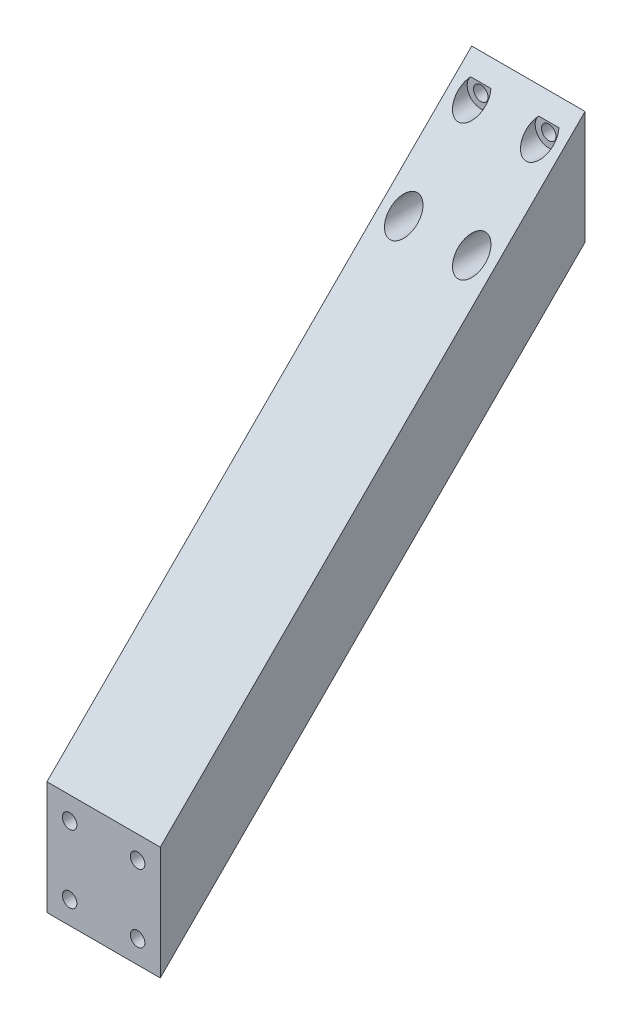
ISO-10303-21;
HEADER;
FILE_DESCRIPTION(('STEP AP214'),'2;1');
FILE_NAME('part.step','',(''),(''),'','','');
FILE_SCHEMA(('AUTOMOTIVE_DESIGN { 1 0 10303 214 1 1 1 1 }'));
ENDSEC;
DATA;
#1=APPLICATION_CONTEXT('core data for automotive mechanical design processes');
#2=APPLICATION_PROTOCOL_DEFINITION('international standard','automotive_design',2000,#1);
#3=PRODUCT_CONTEXT('',#1,'mechanical');
#4=PRODUCT('Part','Part','',(#3));
#5=PRODUCT_RELATED_PRODUCT_CATEGORY('part','',(#4));
#6=PRODUCT_DEFINITION_FORMATION('','',#4);
#7=PRODUCT_DEFINITION_CONTEXT('part definition',#1,'design');
#8=PRODUCT_DEFINITION('design','',#6,#7);
#9=PRODUCT_DEFINITION_SHAPE('','',#8);
#10=(LENGTH_UNIT() NAMED_UNIT(*) SI_UNIT(.MILLI.,.METRE.));
#11=(NAMED_UNIT(*) PLANE_ANGLE_UNIT() SI_UNIT($,.RADIAN.));
#12=(NAMED_UNIT(*) SI_UNIT($,.STERADIAN.) SOLID_ANGLE_UNIT());
#13=UNCERTAINTY_MEASURE_WITH_UNIT(LENGTH_MEASURE(1.E-05),#10,'distance_accuracy_value','');
#14=(GEOMETRIC_REPRESENTATION_CONTEXT(3) GLOBAL_UNCERTAINTY_ASSIGNED_CONTEXT((#13)) GLOBAL_UNIT_ASSIGNED_CONTEXT((#10,
#11,#12)) REPRESENTATION_CONTEXT('',''));
#15=CARTESIAN_POINT('',(0.,0.,0.));
#16=DIRECTION('',(0.,0.,1.));
#17=DIRECTION('',(1.,0.,0.));
#18=AXIS2_PLACEMENT_3D('',#15,#16,#17);
#19=CARTESIAN_POINT('',(25.,25.0000000000001,0.));
#20=DIRECTION('',(0.,0.,1.));
#21=DIRECTION('',(1.,0.,0.));
#22=AXIS2_PLACEMENT_3D('',#19,#20,#21);
#23=PLANE('',#22);
#24=CARTESIAN_POINT('',(20.,20.0000000000001,0.));
#25=DIRECTION('',(0.,0.,-1.));
#26=DIRECTION('',(-1.,0.,0.));
#27=AXIS2_PLACEMENT_3D('',#24,#25,#26);
#28=CIRCLE('',#27,1.6);
#29=CARTESIAN_POINT('',(18.4,20.0000000000001,0.));
#30=VERTEX_POINT('',#29);
#31=EDGE_CURVE('E135',#30,#30,#28,.T.);
#32=ORIENTED_EDGE('',*,*,#31,.F.);
#33=EDGE_LOOP('',(#32));
#34=FACE_BOUND('',#33,.T.);
#35=CARTESIAN_POINT('',(5.,5.00000000000011,0.));
#36=DIRECTION('',(0.,0.,-1.));
#37=DIRECTION('',(-1.,0.,0.));
#38=AXIS2_PLACEMENT_3D('',#35,#36,#37);
#39=CIRCLE('',#38,1.6);
#40=CARTESIAN_POINT('',(3.4,5.00000000000011,0.));
#41=VERTEX_POINT('',#40);
#42=EDGE_CURVE('E134',#41,#41,#39,.T.);
#43=ORIENTED_EDGE('',*,*,#42,.F.);
#44=EDGE_LOOP('',(#43));
#45=FACE_BOUND('',#44,.T.);
#46=CARTESIAN_POINT('',(20.,5.00000000000011,0.));
#47=DIRECTION('',(0.,0.,-1.));
#48=DIRECTION('',(-1.,0.,0.));
#49=AXIS2_PLACEMENT_3D('',#46,#47,#48);
#50=CIRCLE('',#49,1.6);
#51=CARTESIAN_POINT('',(18.4,5.00000000000011,0.));
#52=VERTEX_POINT('',#51);
#53=EDGE_CURVE('E126',#52,#52,#50,.T.);
#54=ORIENTED_EDGE('',*,*,#53,.F.);
#55=EDGE_LOOP('',(#54));
#56=FACE_BOUND('',#55,.T.);
#57=CARTESIAN_POINT('',(5.,20.0000000000001,0.));
#58=DIRECTION('',(0.,0.,-1.));
#59=DIRECTION('',(-1.,0.,0.));
#60=AXIS2_PLACEMENT_3D('',#57,#58,#59);
#61=CIRCLE('',#60,1.6);
#62=CARTESIAN_POINT('',(3.4,20.0000000000001,0.));
#63=VERTEX_POINT('',#62);
#64=EDGE_CURVE('E142',#63,#63,#61,.T.);
#65=ORIENTED_EDGE('',*,*,#64,.F.);
#66=EDGE_LOOP('',(#65));
#67=FACE_BOUND('',#66,.T.);
#68=DIRECTION('',(0.,1.,0.));
#69=VECTOR('',#68,1.);
#70=CARTESIAN_POINT('',(0.,25.0000000000001,0.));
#71=LINE('',#70,#69);
#72=CARTESIAN_POINT('',(0.,0.,0.));
#73=VERTEX_POINT('',#72);
#74=CARTESIAN_POINT('',(0.,25.0000000000001,0.));
#75=VERTEX_POINT('',#74);
#76=EDGE_CURVE('E178',#73,#75,#71,.T.);
#77=ORIENTED_EDGE('',*,*,#76,.T.);
#78=DIRECTION('',(-1.,0.,0.));
#79=VECTOR('',#78,1.);
#80=CARTESIAN_POINT('',(25.,25.0000000000001,0.));
#81=LINE('',#80,#79);
#82=CARTESIAN_POINT('',(25.,25.0000000000001,0.));
#83=VERTEX_POINT('',#82);
#84=EDGE_CURVE('E11',#83,#75,#81,.T.);
#85=ORIENTED_EDGE('',*,*,#84,.F.);
#86=DIRECTION('',(0.,1.,0.));
#87=VECTOR('',#86,1.);
#88=CARTESIAN_POINT('',(25.,25.0000000000001,0.));
#89=LINE('',#88,#87);
#90=CARTESIAN_POINT('',(25.,0.,0.));
#91=VERTEX_POINT('',#90);
#92=EDGE_CURVE('E179',#91,#83,#89,.T.);
#93=ORIENTED_EDGE('',*,*,#92,.F.);
#94=DIRECTION('',(-1.,0.,0.));
#95=VECTOR('',#94,1.);
#96=CARTESIAN_POINT('',(25.,0.,0.));
#97=LINE('',#96,#95);
#98=EDGE_CURVE('E189',#91,#73,#97,.T.);
#99=ORIENTED_EDGE('',*,*,#98,.T.);
#100=EDGE_LOOP('',(#77,#85,#93,#99));
#101=FACE_BOUND('',#100,.T.);
#102=ADVANCED_FACE('F33',(#34,#45,#56,#67,#101),#23,.F.);
#103=CARTESIAN_POINT('',(25.,-68.70992099,93.7099209899996));
#104=DIRECTION('',(0.,-0.707106781186546,-0.707106781186549));
#105=DIRECTION('',(0.,0.707106781186549,-0.707106781186546));
#106=AXIS2_PLACEMENT_3D('',#103,#104,#105);
#107=PLANE('',#106);
#108=DIRECTION('',(-1.,0.,0.));
#109=VECTOR('',#108,1.);
#110=CARTESIAN_POINT('',(5.,22.0000000000001,3.));
#111=LINE('',#110,#109);
#112=CARTESIAN_POINT('',(7.23606797749983,22.0000000000001,3.));
#113=VERTEX_POINT('',#112);
#114=CARTESIAN_POINT('',(2.76393202250017,22.0000000000001,3.));
#115=VERTEX_POINT('',#114);
#116=EDGE_CURVE('E152',#113,#115,#111,.T.);
#117=ORIENTED_EDGE('',*,*,#116,.F.);
#118=CARTESIAN_POINT('',(5.,20.0000000000001,4.99999999999995));
#119=DIRECTION('',(0.,-0.707106781186546,-0.707106781186549));
#120=DIRECTION('',(0.,0.707106781186549,-0.707106781186546));
#121=AXIS2_PLACEMENT_3D('',#118,#119,#120);
#122=ELLIPSE('',#121,4.24264068711928,3.);
#123=EDGE_CURVE('E169',#115,#113,#122,.F.);
#124=ORIENTED_EDGE('',*,*,#123,.F.);
#125=EDGE_LOOP('',(#117,#124));
#126=FACE_BOUND('',#125,.T.);
#127=CARTESIAN_POINT('',(5.,5.00000000000011,19.9999999999999));
#128=DIRECTION('',(0.,-0.707106781186546,-0.707106781186549));
#129=DIRECTION('',(0.,0.707106781186549,-0.707106781186546));
#130=AXIS2_PLACEMENT_3D('',#127,#128,#129);
#131=ELLIPSE('',#130,4.24264068711928,3.);
#132=CARTESIAN_POINT('',(5.,8.00000000000012,16.9999999999999));
#133=VERTEX_POINT('',#132);
#134=EDGE_CURVE('E160',#133,#133,#131,.F.);
#135=ORIENTED_EDGE('',*,*,#134,.F.);
#136=EDGE_LOOP('',(#135));
#137=FACE_BOUND('',#136,.T.);
#138=CARTESIAN_POINT('',(20.,5.00000000000011,19.9999999999999));
#139=DIRECTION('',(0.,-0.707106781186546,-0.707106781186549));
#140=DIRECTION('',(0.,0.707106781186549,-0.707106781186546));
#141=AXIS2_PLACEMENT_3D('',#138,#139,#140);
#142=ELLIPSE('',#141,4.24264068711928,3.);
#143=CARTESIAN_POINT('',(20.,8.00000000000012,16.9999999999999));
#144=VERTEX_POINT('',#143);
#145=EDGE_CURVE('E153',#144,#144,#142,.F.);
#146=ORIENTED_EDGE('',*,*,#145,.F.);
#147=EDGE_LOOP('',(#146));
#148=FACE_BOUND('',#147,.T.);
#149=DIRECTION('',(-1.,0.,0.));
#150=VECTOR('',#149,1.);
#151=CARTESIAN_POINT('',(20.,22.0000000000001,3.));
#152=LINE('',#151,#150);
#153=CARTESIAN_POINT('',(22.2360679774998,22.0000000000001,3.));
#154=VERTEX_POINT('',#153);
#155=CARTESIAN_POINT('',(17.7639320225002,22.0000000000001,3.));
#156=VERTEX_POINT('',#155);
#157=EDGE_CURVE('E156',#154,#156,#152,.T.);
#158=ORIENTED_EDGE('',*,*,#157,.F.);
#159=CARTESIAN_POINT('',(20.,20.0000000000001,4.99999999999995));
#160=DIRECTION('',(0.,-0.707106781186546,-0.707106781186549));
#161=DIRECTION('',(0.,0.707106781186549,-0.707106781186546));
#162=AXIS2_PLACEMENT_3D('',#159,#160,#161);
#163=ELLIPSE('',#162,4.24264068711928,3.);
#164=EDGE_CURVE('E174',#156,#154,#163,.F.);
#165=ORIENTED_EDGE('',*,*,#164,.F.);
#166=EDGE_LOOP('',(#158,#165));
#167=FACE_BOUND('',#166,.T.);
#168=DIRECTION('',(0.,-0.707106781186549,0.707106781186546));
#169=VECTOR('',#168,1.);
#170=CARTESIAN_POINT('',(0.,-68.70992099,93.7099209899996));
#171=LINE('',#170,#169);
#172=CARTESIAN_POINT('',(0.,-68.70992099,93.7099209899996));
#173=VERTEX_POINT('',#172);
#174=EDGE_CURVE('E192',#75,#173,#171,.T.);
#175=ORIENTED_EDGE('',*,*,#174,.T.);
#176=DIRECTION('',(-1.,0.,0.));
#177=VECTOR('',#176,1.);
#178=CARTESIAN_POINT('',(25.,-68.70992099,93.7099209899996));
#179=LINE('',#178,#177);
#180=CARTESIAN_POINT('',(25.,-68.70992099,93.7099209899996));
#181=VERTEX_POINT('',#180);
#182=EDGE_CURVE('E40',#181,#173,#179,.T.);
#183=ORIENTED_EDGE('',*,*,#182,.F.);
#184=DIRECTION('',(0.,-0.707106781186549,0.707106781186546));
#185=VECTOR('',#184,1.);
#186=CARTESIAN_POINT('',(25.,-68.70992099,93.7099209899996));
#187=LINE('',#186,#185);
#188=EDGE_CURVE('E182',#83,#181,#187,.T.);
#189=ORIENTED_EDGE('',*,*,#188,.F.);
#190=ORIENTED_EDGE('',*,*,#84,.T.);
#191=EDGE_LOOP('',(#175,#183,#189,#190));
#192=FACE_BOUND('',#191,.T.);
#193=ADVANCED_FACE('F221',(#126,#137,#148,#167,#192),#107,.F.);
#194=CARTESIAN_POINT('',(25.,-93.70992099,93.7099209899996));
#195=DIRECTION('',(0.,0.,-1.));
#196=DIRECTION('',(0.,1.,0.));
#197=AXIS2_PLACEMENT_3D('',#194,#195,#196);
#198=PLANE('',#197);
#199=CARTESIAN_POINT('',(5.,-88.70992099,93.7099209899996));
#200=DIRECTION('',(0.,0.,1.));
#201=DIRECTION('',(1.,0.,0.));
#202=AXIS2_PLACEMENT_3D('',#199,#200,#201);
#203=CIRCLE('',#202,1.6);
#204=CARTESIAN_POINT('',(6.6,-88.70992099,93.7099209899996));
#205=VERTEX_POINT('',#204);
#206=EDGE_CURVE('E354',#205,#205,#203,.T.);
#207=ORIENTED_EDGE('',*,*,#206,.F.);
#208=EDGE_LOOP('',(#207));
#209=FACE_BOUND('',#208,.T.);
#210=CARTESIAN_POINT('',(20.,-88.70992099,93.7099209899996));
#211=DIRECTION('',(0.,0.,1.));
#212=DIRECTION('',(1.,0.,0.));
#213=AXIS2_PLACEMENT_3D('',#210,#211,#212);
#214=CIRCLE('',#213,1.60000000000001);
#215=CARTESIAN_POINT('',(21.6,-88.70992099,93.7099209899996));
#216=VERTEX_POINT('',#215);
#217=EDGE_CURVE('E348',#216,#216,#214,.T.);
#218=ORIENTED_EDGE('',*,*,#217,.F.);
#219=EDGE_LOOP('',(#218));
#220=FACE_BOUND('',#219,.T.);
#221=CARTESIAN_POINT('',(20.,-73.70992099,93.7099209899996));
#222=DIRECTION('',(0.,0.,1.));
#223=DIRECTION('',(1.,0.,0.));
#224=AXIS2_PLACEMENT_3D('',#221,#222,#223);
#225=CIRCLE('',#224,1.6);
#226=CARTESIAN_POINT('',(21.6,-73.70992099,93.7099209899996));
#227=VERTEX_POINT('',#226);
#228=EDGE_CURVE('E337',#227,#227,#225,.T.);
#229=ORIENTED_EDGE('',*,*,#228,.F.);
#230=EDGE_LOOP('',(#229));
#231=FACE_BOUND('',#230,.T.);
#232=CARTESIAN_POINT('',(5.,-73.70992099,93.7099209899996));
#233=DIRECTION('',(0.,0.,1.));
#234=DIRECTION('',(1.,0.,0.));
#235=AXIS2_PLACEMENT_3D('',#232,#233,#234);
#236=CIRCLE('',#235,1.6);
#237=CARTESIAN_POINT('',(6.6,-73.70992099,93.7099209899996));
#238=VERTEX_POINT('',#237);
#239=EDGE_CURVE('E341',#238,#238,#236,.T.);
#240=ORIENTED_EDGE('',*,*,#239,.F.);
#241=EDGE_LOOP('',(#240));
#242=FACE_BOUND('',#241,.T.);
#243=DIRECTION('',(0.,-1.,0.));
#244=VECTOR('',#243,1.);
#245=CARTESIAN_POINT('',(0.,-93.70992099,93.7099209899996));
#246=LINE('',#245,#244);
#247=CARTESIAN_POINT('',(0.,-93.70992099,93.7099209899996));
#248=VERTEX_POINT('',#247);
#249=EDGE_CURVE('E194',#173,#248,#246,.T.);
#250=ORIENTED_EDGE('',*,*,#249,.T.);
#251=DIRECTION('',(-1.,0.,0.));
#252=VECTOR('',#251,1.);
#253=CARTESIAN_POINT('',(25.,-93.70992099,93.7099209899996));
#254=LINE('',#253,#252);
#255=CARTESIAN_POINT('',(25.,-93.70992099,93.7099209899996));
#256=VERTEX_POINT('',#255);
#257=EDGE_CURVE('E199',#256,#248,#254,.T.);
#258=ORIENTED_EDGE('',*,*,#257,.F.);
#259=DIRECTION('',(0.,-1.,0.));
#260=VECTOR('',#259,1.);
#261=CARTESIAN_POINT('',(25.,-93.70992099,93.7099209899996));
#262=LINE('',#261,#260);
#263=EDGE_CURVE('E185',#181,#256,#262,.T.);
#264=ORIENTED_EDGE('',*,*,#263,.F.);
#265=ORIENTED_EDGE('',*,*,#182,.T.);
#266=EDGE_LOOP('',(#250,#258,#264,#265));
#267=FACE_BOUND('',#266,.T.);
#268=ADVANCED_FACE('F206',(#209,#220,#231,#242,#267),#198,.F.);
#269=CARTESIAN_POINT('',(25.,0.,0.));
#270=DIRECTION('',(0.,0.707106781186546,0.707106781186549));
#271=DIRECTION('',(0.,-0.707106781186549,0.707106781186546));
#272=AXIS2_PLACEMENT_3D('',#269,#270,#271);
#273=PLANE('',#272);
#274=CARTESIAN_POINT('',(20.,-73.70992099,73.7099209899996));
#275=DIRECTION('',(0.,0.707106781186546,0.707106781186549));
#276=DIRECTION('',(0.,-0.707106781186549,0.707106781186546));
#277=AXIS2_PLACEMENT_3D('',#274,#275,#276);
#278=ELLIPSE('',#277,4.24264068711928,3.);
#279=CARTESIAN_POINT('',(20.,-76.70992099,76.7099209899996));
#280=VERTEX_POINT('',#279);
#281=EDGE_CURVE('E114',#280,#280,#278,.F.);
#282=ORIENTED_EDGE('',*,*,#281,.F.);
#283=EDGE_LOOP('',(#282));
#284=FACE_BOUND('',#283,.T.);
#285=DIRECTION('',(-1.,0.,0.));
#286=VECTOR('',#285,1.);
#287=CARTESIAN_POINT('',(20.,-90.70992099,90.7099209899996));
#288=LINE('',#287,#286);
#289=CARTESIAN_POINT('',(22.2360679774998,-90.7099209899999,90.7099209899996));
#290=VERTEX_POINT('',#289);
#291=CARTESIAN_POINT('',(17.7639320225002,-90.70992099,90.7099209899996));
#292=VERTEX_POINT('',#291);
#293=EDGE_CURVE('E111',#290,#292,#288,.T.);
#294=ORIENTED_EDGE('',*,*,#293,.F.);
#295=CARTESIAN_POINT('',(20.,-88.70992099,88.7099209899996));
#296=DIRECTION('',(0.,0.707106781186546,0.707106781186549));
#297=DIRECTION('',(0.,-0.707106781186549,0.707106781186546));
#298=AXIS2_PLACEMENT_3D('',#295,#296,#297);
#299=ELLIPSE('',#298,4.24264068711928,3.);
#300=EDGE_CURVE('E46',#292,#290,#299,.F.);
#301=ORIENTED_EDGE('',*,*,#300,.F.);
#302=EDGE_LOOP('',(#294,#301));
#303=FACE_BOUND('',#302,.T.);
#304=DIRECTION('',(-1.,0.,0.));
#305=VECTOR('',#304,1.);
#306=CARTESIAN_POINT('',(5.,-90.70992099,90.7099209899996));
#307=LINE('',#306,#305);
#308=CARTESIAN_POINT('',(7.2360679774998,-90.7099209899999,90.7099209899996));
#309=VERTEX_POINT('',#308);
#310=CARTESIAN_POINT('',(2.7639320225002,-90.70992099,90.7099209899996));
#311=VERTEX_POINT('',#310);
#312=EDGE_CURVE('E101',#309,#311,#307,.T.);
#313=ORIENTED_EDGE('',*,*,#312,.F.);
#314=CARTESIAN_POINT('',(5.,-88.70992099,88.7099209899996));
#315=DIRECTION('',(0.,0.707106781186546,0.707106781186549));
#316=DIRECTION('',(0.,-0.707106781186549,0.707106781186546));
#317=AXIS2_PLACEMENT_3D('',#314,#315,#316);
#318=ELLIPSE('',#317,4.24264068711928,3.00000000000001);
#319=EDGE_CURVE('E53',#311,#309,#318,.F.);
#320=ORIENTED_EDGE('',*,*,#319,.F.);
#321=EDGE_LOOP('',(#313,#320));
#322=FACE_BOUND('',#321,.T.);
#323=CARTESIAN_POINT('',(5.,-73.70992099,73.7099209899996));
#324=DIRECTION('',(0.,0.707106781186546,0.707106781186549));
#325=DIRECTION('',(0.,-0.707106781186549,0.707106781186546));
#326=AXIS2_PLACEMENT_3D('',#323,#324,#325);
#327=ELLIPSE('',#326,4.24264068711928,3.00000000000001);
#328=CARTESIAN_POINT('',(5.,-76.70992099,76.7099209899996));
#329=VERTEX_POINT('',#328);
#330=EDGE_CURVE('E123',#329,#329,#327,.F.);
#331=ORIENTED_EDGE('',*,*,#330,.F.);
#332=EDGE_LOOP('',(#331));
#333=FACE_BOUND('',#332,.T.);
#334=DIRECTION('',(0.,0.707106781186549,-0.707106781186546));
#335=VECTOR('',#334,1.);
#336=CARTESIAN_POINT('',(0.,0.,0.));
#337=LINE('',#336,#335);
#338=EDGE_CURVE('E183',#248,#73,#337,.T.);
#339=ORIENTED_EDGE('',*,*,#338,.T.);
#340=ORIENTED_EDGE('',*,*,#98,.F.);
#341=DIRECTION('',(0.,0.707106781186549,-0.707106781186546));
#342=VECTOR('',#341,1.);
#343=CARTESIAN_POINT('',(25.,0.,0.));
#344=LINE('',#343,#342);
#345=EDGE_CURVE('E187',#256,#91,#344,.T.);
#346=ORIENTED_EDGE('',*,*,#345,.F.);
#347=ORIENTED_EDGE('',*,*,#257,.T.);
#348=EDGE_LOOP('',(#339,#340,#346,#347));
#349=FACE_BOUND('',#348,.T.);
#350=ADVANCED_FACE('F106',(#284,#303,#322,#333,#349),#273,.F.);
#351=CARTESIAN_POINT('',(25.,0.,0.));
#352=DIRECTION('',(-1.,0.,0.));
#353=DIRECTION('',(0.,0.,1.));
#354=AXIS2_PLACEMENT_3D('',#351,#352,#353);
#355=PLANE('',#354);
#356=ORIENTED_EDGE('',*,*,#92,.T.);
#357=ORIENTED_EDGE('',*,*,#188,.T.);
#358=ORIENTED_EDGE('',*,*,#263,.T.);
#359=ORIENTED_EDGE('',*,*,#345,.T.);
#360=EDGE_LOOP('',(#356,#357,#358,#359));
#361=FACE_BOUND('',#360,.T.);
#362=ADVANCED_FACE('F220',(#361),#355,.F.);
#363=CARTESIAN_POINT('',(0.,0.,0.));
#364=DIRECTION('',(-1.,0.,0.));
#365=DIRECTION('',(0.,0.,1.));
#366=AXIS2_PLACEMENT_3D('',#363,#364,#365);
#367=PLANE('',#366);
#368=ORIENTED_EDGE('',*,*,#76,.F.);
#369=ORIENTED_EDGE('',*,*,#338,.F.);
#370=ORIENTED_EDGE('',*,*,#249,.F.);
#371=ORIENTED_EDGE('',*,*,#174,.F.);
#372=EDGE_LOOP('',(#368,#369,#370,#371));
#373=FACE_BOUND('',#372,.T.);
#374=ADVANCED_FACE('F212',(#373),#367,.T.);
#375=CARTESIAN_POINT('',(20.,20.0000000000001,93.7109209899996));
#376=DIRECTION('',(0.,0.,-1.));
#377=DIRECTION('',(-1.,0.,0.));
#378=AXIS2_PLACEMENT_3D('',#375,#376,#377);
#379=CYLINDRICAL_SURFACE('',#378,3.);
#380=ORIENTED_EDGE('',*,*,#164,.T.);
#381=CARTESIAN_POINT('',(20.,20.0000000000001,3.));
#382=DIRECTION('',(0.,0.,-1.));
#383=DIRECTION('',(-1.,0.,0.));
#384=AXIS2_PLACEMENT_3D('',#381,#382,#383);
#385=CIRCLE('',#384,3.);
#386=EDGE_CURVE('E176',#154,#156,#385,.T.);
#387=ORIENTED_EDGE('',*,*,#386,.T.);
#388=EDGE_LOOP('',(#380,#387));
#389=FACE_BOUND('',#388,.T.);
#390=ADVANCED_FACE('F239',(#389),#379,.F.);
#391=CARTESIAN_POINT('',(20.,20.0000000000001,3.));
#392=DIRECTION('',(0.,0.,-1.));
#393=DIRECTION('',(-1.,0.,0.));
#394=AXIS2_PLACEMENT_3D('',#391,#392,#393);
#395=PLANE('',#394);
#396=CARTESIAN_POINT('',(20.,20.0000000000001,3.));
#397=DIRECTION('',(0.,0.,-1.));
#398=DIRECTION('',(-1.,0.,0.));
#399=AXIS2_PLACEMENT_3D('',#396,#397,#398);
#400=CIRCLE('',#399,1.6);
#401=CARTESIAN_POINT('',(18.4,20.0000000000001,3.));
#402=VERTEX_POINT('',#401);
#403=EDGE_CURVE('E138',#402,#402,#400,.F.);
#404=ORIENTED_EDGE('',*,*,#403,.F.);
#405=EDGE_LOOP('',(#404));
#406=FACE_BOUND('',#405,.T.);
#407=ORIENTED_EDGE('',*,*,#157,.T.);
#408=ORIENTED_EDGE('',*,*,#386,.F.);
#409=EDGE_LOOP('',(#407,#408));
#410=FACE_BOUND('',#409,.T.);
#411=ADVANCED_FACE('F244',(#406,#410),#395,.F.);
#412=CARTESIAN_POINT('',(20.,5.00000000000011,93.7109209899996));
#413=DIRECTION('',(0.,0.,-1.));
#414=DIRECTION('',(-1.,0.,0.));
#415=AXIS2_PLACEMENT_3D('',#412,#413,#414);
#416=CYLINDRICAL_SURFACE('',#415,3.);
#417=CARTESIAN_POINT('',(20.,5.00000000000011,3.));
#418=DIRECTION('',(0.,0.,-1.));
#419=DIRECTION('',(-1.,0.,0.));
#420=AXIS2_PLACEMENT_3D('',#417,#418,#419);
#421=CIRCLE('',#420,3.);
#422=CARTESIAN_POINT('',(17.,5.00000000000011,3.));
#423=VERTEX_POINT('',#422);
#424=EDGE_CURVE('E157',#423,#423,#421,.T.);
#425=ORIENTED_EDGE('',*,*,#424,.T.);
#426=EDGE_LOOP('',(#425));
#427=FACE_BOUND('',#426,.T.);
#428=ORIENTED_EDGE('',*,*,#145,.T.);
#429=EDGE_LOOP('',(#428));
#430=FACE_BOUND('',#429,.T.);
#431=ADVANCED_FACE('F248',(#427,#430),#416,.F.);
#432=CARTESIAN_POINT('',(20.,5.00000000000011,3.));
#433=DIRECTION('',(0.,0.,-1.));
#434=DIRECTION('',(-1.,0.,0.));
#435=AXIS2_PLACEMENT_3D('',#432,#433,#434);
#436=PLANE('',#435);
#437=CARTESIAN_POINT('',(20.,5.00000000000011,3.));
#438=DIRECTION('',(0.,0.,-1.));
#439=DIRECTION('',(-1.,0.,0.));
#440=AXIS2_PLACEMENT_3D('',#437,#438,#439);
#441=CIRCLE('',#440,1.6);
#442=CARTESIAN_POINT('',(18.4,5.00000000000011,3.));
#443=VERTEX_POINT('',#442);
#444=EDGE_CURVE('E131',#443,#443,#441,.F.);
#445=ORIENTED_EDGE('',*,*,#444,.F.);
#446=EDGE_LOOP('',(#445));
#447=FACE_BOUND('',#446,.T.);
#448=ORIENTED_EDGE('',*,*,#424,.F.);
#449=EDGE_LOOP('',(#448));
#450=FACE_BOUND('',#449,.T.);
#451=ADVANCED_FACE('F263',(#447,#450),#436,.F.);
#452=CARTESIAN_POINT('',(5.,5.00000000000011,93.7109209899996));
#453=DIRECTION('',(0.,0.,-1.));
#454=DIRECTION('',(-1.,0.,0.));
#455=AXIS2_PLACEMENT_3D('',#452,#453,#454);
#456=CYLINDRICAL_SURFACE('',#455,3.);
#457=CARTESIAN_POINT('',(5.,5.00000000000011,3.));
#458=DIRECTION('',(0.,0.,-1.));
#459=DIRECTION('',(-1.,0.,0.));
#460=AXIS2_PLACEMENT_3D('',#457,#458,#459);
#461=CIRCLE('',#460,3.);
#462=CARTESIAN_POINT('',(2.,5.00000000000011,3.));
#463=VERTEX_POINT('',#462);
#464=EDGE_CURVE('E163',#463,#463,#461,.T.);
#465=ORIENTED_EDGE('',*,*,#464,.T.);
#466=EDGE_LOOP('',(#465));
#467=FACE_BOUND('',#466,.T.);
#468=ORIENTED_EDGE('',*,*,#134,.T.);
#469=EDGE_LOOP('',(#468));
#470=FACE_BOUND('',#469,.T.);
#471=ADVANCED_FACE('F260',(#467,#470),#456,.F.);
#472=CARTESIAN_POINT('',(5.,5.00000000000011,3.));
#473=DIRECTION('',(0.,0.,-1.));
#474=DIRECTION('',(-1.,0.,0.));
#475=AXIS2_PLACEMENT_3D('',#472,#473,#474);
#476=PLANE('',#475);
#477=CARTESIAN_POINT('',(5.,5.00000000000011,3.));
#478=DIRECTION('',(0.,0.,-1.));
#479=DIRECTION('',(-1.,0.,0.));
#480=AXIS2_PLACEMENT_3D('',#477,#478,#479);
#481=CIRCLE('',#480,1.6);
#482=CARTESIAN_POINT('',(3.4,5.00000000000011,3.));
#483=VERTEX_POINT('',#482);
#484=EDGE_CURVE('E139',#483,#483,#481,.F.);
#485=ORIENTED_EDGE('',*,*,#484,.F.);
#486=EDGE_LOOP('',(#485));
#487=FACE_BOUND('',#486,.T.);
#488=ORIENTED_EDGE('',*,*,#464,.F.);
#489=EDGE_LOOP('',(#488));
#490=FACE_BOUND('',#489,.T.);
#491=ADVANCED_FACE('F254',(#487,#490),#476,.F.);
#492=CARTESIAN_POINT('',(5.,20.0000000000001,93.7109209899996));
#493=DIRECTION('',(0.,0.,-1.));
#494=DIRECTION('',(-1.,0.,0.));
#495=AXIS2_PLACEMENT_3D('',#492,#493,#494);
#496=CYLINDRICAL_SURFACE('',#495,3.);
#497=ORIENTED_EDGE('',*,*,#123,.T.);
#498=CARTESIAN_POINT('',(5.,20.0000000000001,3.));
#499=DIRECTION('',(0.,0.,-1.));
#500=DIRECTION('',(-1.,0.,0.));
#501=AXIS2_PLACEMENT_3D('',#498,#499,#500);
#502=CIRCLE('',#501,3.);
#503=EDGE_CURVE('E166',#113,#115,#502,.T.);
#504=ORIENTED_EDGE('',*,*,#503,.T.);
#505=EDGE_LOOP('',(#497,#504));
#506=FACE_BOUND('',#505,.T.);
#507=ADVANCED_FACE('F250',(#506),#496,.F.);
#508=CARTESIAN_POINT('',(5.,20.0000000000001,3.));
#509=DIRECTION('',(0.,0.,-1.));
#510=DIRECTION('',(-1.,0.,0.));
#511=AXIS2_PLACEMENT_3D('',#508,#509,#510);
#512=PLANE('',#511);
#513=CARTESIAN_POINT('',(5.,20.0000000000001,3.));
#514=DIRECTION('',(0.,0.,-1.));
#515=DIRECTION('',(-1.,0.,0.));
#516=AXIS2_PLACEMENT_3D('',#513,#514,#515);
#517=CIRCLE('',#516,1.6);
#518=CARTESIAN_POINT('',(3.4,20.0000000000001,3.));
#519=VERTEX_POINT('',#518);
#520=EDGE_CURVE('E149',#519,#519,#517,.F.);
#521=ORIENTED_EDGE('',*,*,#520,.F.);
#522=EDGE_LOOP('',(#521));
#523=FACE_BOUND('',#522,.T.);
#524=ORIENTED_EDGE('',*,*,#116,.T.);
#525=ORIENTED_EDGE('',*,*,#503,.F.);
#526=EDGE_LOOP('',(#524,#525));
#527=FACE_BOUND('',#526,.T.);
#528=ADVANCED_FACE('F253',(#523,#527),#512,.F.);
#529=CARTESIAN_POINT('',(5.,20.0000000000001,93.7109209899996));
#530=DIRECTION('',(0.,0.,-1.));
#531=DIRECTION('',(-1.,0.,0.));
#532=AXIS2_PLACEMENT_3D('',#529,#530,#531);
#533=CYLINDRICAL_SURFACE('',#532,1.6);
#534=ORIENTED_EDGE('',*,*,#64,.T.);
#535=EDGE_LOOP('',(#534));
#536=FACE_BOUND('',#535,.T.);
#537=ORIENTED_EDGE('',*,*,#520,.T.);
#538=EDGE_LOOP('',(#537));
#539=FACE_BOUND('',#538,.T.);
#540=ADVANCED_FACE('F258',(#536,#539),#533,.F.);
#541=CARTESIAN_POINT('',(5.,5.00000000000011,93.7109209899996));
#542=DIRECTION('',(0.,0.,-1.));
#543=DIRECTION('',(-1.,0.,0.));
#544=AXIS2_PLACEMENT_3D('',#541,#542,#543);
#545=CYLINDRICAL_SURFACE('',#544,1.6);
#546=ORIENTED_EDGE('',*,*,#42,.T.);
#547=EDGE_LOOP('',(#546));
#548=FACE_BOUND('',#547,.T.);
#549=ORIENTED_EDGE('',*,*,#484,.T.);
#550=EDGE_LOOP('',(#549));
#551=FACE_BOUND('',#550,.T.);
#552=ADVANCED_FACE('F276',(#548,#551),#545,.F.);
#553=CARTESIAN_POINT('',(20.,5.00000000000011,93.7109209899996));
#554=DIRECTION('',(0.,0.,-1.));
#555=DIRECTION('',(-1.,0.,0.));
#556=AXIS2_PLACEMENT_3D('',#553,#554,#555);
#557=CYLINDRICAL_SURFACE('',#556,1.6);
#558=ORIENTED_EDGE('',*,*,#53,.T.);
#559=EDGE_LOOP('',(#558));
#560=FACE_BOUND('',#559,.T.);
#561=ORIENTED_EDGE('',*,*,#444,.T.);
#562=EDGE_LOOP('',(#561));
#563=FACE_BOUND('',#562,.T.);
#564=ADVANCED_FACE('F280',(#560,#563),#557,.F.);
#565=CARTESIAN_POINT('',(20.,20.0000000000001,93.7109209899996));
#566=DIRECTION('',(0.,0.,-1.));
#567=DIRECTION('',(-1.,0.,0.));
#568=AXIS2_PLACEMENT_3D('',#565,#566,#567);
#569=CYLINDRICAL_SURFACE('',#568,1.6);
#570=ORIENTED_EDGE('',*,*,#31,.T.);
#571=EDGE_LOOP('',(#570));
#572=FACE_BOUND('',#571,.T.);
#573=ORIENTED_EDGE('',*,*,#403,.T.);
#574=EDGE_LOOP('',(#573));
#575=FACE_BOUND('',#574,.T.);
#576=ADVANCED_FACE('F282',(#572,#575),#569,.F.);
#577=CARTESIAN_POINT('',(5.,-73.70992099,-0.001000000000001));
#578=DIRECTION('',(0.,0.,1.));
#579=DIRECTION('',(1.,0.,0.));
#580=AXIS2_PLACEMENT_3D('',#577,#578,#579);
#581=CYLINDRICAL_SURFACE('',#580,3.00000000000001);
#582=CARTESIAN_POINT('',(5.,-73.70992099,90.7099209899996));
#583=DIRECTION('',(0.,0.,1.));
#584=DIRECTION('',(1.,0.,0.));
#585=AXIS2_PLACEMENT_3D('',#582,#583,#584);
#586=CIRCLE('',#585,3.00000000000001);
#587=CARTESIAN_POINT('',(8.00000000000001,-73.70992099,90.7099209899996));
#588=VERTEX_POINT('',#587);
#589=EDGE_CURVE('E99',#588,#588,#586,.T.);
#590=ORIENTED_EDGE('',*,*,#589,.T.);
#591=EDGE_LOOP('',(#590));
#592=FACE_BOUND('',#591,.T.);
#593=ORIENTED_EDGE('',*,*,#330,.T.);
#594=EDGE_LOOP('',(#593));
#595=FACE_BOUND('',#594,.T.);
#596=ADVANCED_FACE('F285',(#592,#595),#581,.F.);
#597=CARTESIAN_POINT('',(5.,-73.70992099,90.7099209899996));
#598=DIRECTION('',(0.,0.,1.));
#599=DIRECTION('',(1.,0.,0.));
#600=AXIS2_PLACEMENT_3D('',#597,#598,#599);
#601=PLANE('',#600);
#602=CARTESIAN_POINT('',(5.,-73.70992099,90.7099209899996));
#603=DIRECTION('',(0.,0.,1.));
#604=DIRECTION('',(1.,0.,0.));
#605=AXIS2_PLACEMENT_3D('',#602,#603,#604);
#606=CIRCLE('',#605,1.6);
#607=CARTESIAN_POINT('',(6.6,-73.70992099,90.7099209899996));
#608=VERTEX_POINT('',#607);
#609=EDGE_CURVE('E122',#608,#608,#606,.F.);
#610=ORIENTED_EDGE('',*,*,#609,.F.);
#611=EDGE_LOOP('',(#610));
#612=FACE_BOUND('',#611,.T.);
#613=ORIENTED_EDGE('',*,*,#589,.F.);
#614=EDGE_LOOP('',(#613));
#615=FACE_BOUND('',#614,.T.);
#616=ADVANCED_FACE('F292',(#612,#615),#601,.F.);
#617=CARTESIAN_POINT('',(5.,-88.70992099,-0.001000000000001));
#618=DIRECTION('',(0.,0.,1.));
#619=DIRECTION('',(1.,0.,0.));
#620=AXIS2_PLACEMENT_3D('',#617,#618,#619);
#621=CYLINDRICAL_SURFACE('',#620,3.00000000000001);
#622=ORIENTED_EDGE('',*,*,#319,.T.);
#623=CARTESIAN_POINT('',(5.,-88.70992099,90.7099209899996));
#624=DIRECTION('',(0.,0.,1.));
#625=DIRECTION('',(1.,0.,0.));
#626=AXIS2_PLACEMENT_3D('',#623,#624,#625);
#627=CIRCLE('',#626,3.00000000000001);
#628=EDGE_CURVE('E94',#309,#311,#627,.T.);
#629=ORIENTED_EDGE('',*,*,#628,.T.);
#630=EDGE_LOOP('',(#622,#629));
#631=FACE_BOUND('',#630,.T.);
#632=ADVANCED_FACE('F96',(#631),#621,.F.);
#633=CARTESIAN_POINT('',(5.,-88.70992099,90.7099209899996));
#634=DIRECTION('',(0.,0.,1.));
#635=DIRECTION('',(1.,0.,0.));
#636=AXIS2_PLACEMENT_3D('',#633,#634,#635);
#637=PLANE('',#636);
#638=CARTESIAN_POINT('',(5.,-88.70992099,90.7099209899996));
#639=DIRECTION('',(0.,0.,1.));
#640=DIRECTION('',(1.,0.,0.));
#641=AXIS2_PLACEMENT_3D('',#638,#639,#640);
#642=CIRCLE('',#641,1.6);
#643=CARTESIAN_POINT('',(6.6,-88.70992099,90.7099209899996));
#644=VERTEX_POINT('',#643);
#645=EDGE_CURVE('E351',#644,#644,#642,.F.);
#646=ORIENTED_EDGE('',*,*,#645,.F.);
#647=EDGE_LOOP('',(#646));
#648=FACE_BOUND('',#647,.T.);
#649=ORIENTED_EDGE('',*,*,#312,.T.);
#650=ORIENTED_EDGE('',*,*,#628,.F.);
#651=EDGE_LOOP('',(#649,#650));
#652=FACE_BOUND('',#651,.T.);
#653=ADVANCED_FACE('F102',(#648,#652),#637,.F.);
#654=CARTESIAN_POINT('',(20.,-88.70992099,-0.001000000000001));
#655=DIRECTION('',(0.,0.,1.));
#656=DIRECTION('',(1.,0.,0.));
#657=AXIS2_PLACEMENT_3D('',#654,#655,#656);
#658=CYLINDRICAL_SURFACE('',#657,3.);
#659=ORIENTED_EDGE('',*,*,#300,.T.);
#660=CARTESIAN_POINT('',(20.,-88.70992099,90.7099209899996));
#661=DIRECTION('',(0.,0.,1.));
#662=DIRECTION('',(1.,0.,0.));
#663=AXIS2_PLACEMENT_3D('',#660,#661,#662);
#664=CIRCLE('',#663,3.);
#665=EDGE_CURVE('E104',#290,#292,#664,.T.);
#666=ORIENTED_EDGE('',*,*,#665,.T.);
#667=EDGE_LOOP('',(#659,#666));
#668=FACE_BOUND('',#667,.T.);
#669=ADVANCED_FACE('F307',(#668),#658,.F.);
#670=CARTESIAN_POINT('',(20.,-88.70992099,90.7099209899996));
#671=DIRECTION('',(0.,0.,1.));
#672=DIRECTION('',(1.,0.,0.));
#673=AXIS2_PLACEMENT_3D('',#670,#671,#672);
#674=PLANE('',#673);
#675=CARTESIAN_POINT('',(20.,-88.70992099,90.7099209899996));
#676=DIRECTION('',(0.,0.,1.));
#677=DIRECTION('',(1.,0.,0.));
#678=AXIS2_PLACEMENT_3D('',#675,#676,#677);
#679=CIRCLE('',#678,1.60000000000001);
#680=CARTESIAN_POINT('',(21.6,-88.70992099,90.7099209899996));
#681=VERTEX_POINT('',#680);
#682=EDGE_CURVE('E345',#681,#681,#679,.F.);
#683=ORIENTED_EDGE('',*,*,#682,.F.);
#684=EDGE_LOOP('',(#683));
#685=FACE_BOUND('',#684,.T.);
#686=ORIENTED_EDGE('',*,*,#293,.T.);
#687=ORIENTED_EDGE('',*,*,#665,.F.);
#688=EDGE_LOOP('',(#686,#687));
#689=FACE_BOUND('',#688,.T.);
#690=ADVANCED_FACE('F301',(#685,#689),#674,.F.);
#691=CARTESIAN_POINT('',(20.,-73.70992099,-0.001000000000001));
#692=DIRECTION('',(0.,0.,1.));
#693=DIRECTION('',(1.,0.,0.));
#694=AXIS2_PLACEMENT_3D('',#691,#692,#693);
#695=CYLINDRICAL_SURFACE('',#694,3.);
#696=CARTESIAN_POINT('',(20.,-73.70992099,90.7099209899996));
#697=DIRECTION('',(0.,0.,1.));
#698=DIRECTION('',(1.,0.,0.));
#699=AXIS2_PLACEMENT_3D('',#696,#697,#698);
#700=CIRCLE('',#699,3.);
#701=CARTESIAN_POINT('',(23.,-73.70992099,90.7099209899996));
#702=VERTEX_POINT('',#701);
#703=EDGE_CURVE('E119',#702,#702,#700,.T.);
#704=ORIENTED_EDGE('',*,*,#703,.T.);
#705=EDGE_LOOP('',(#704));
#706=FACE_BOUND('',#705,.T.);
#707=ORIENTED_EDGE('',*,*,#281,.T.);
#708=EDGE_LOOP('',(#707));
#709=FACE_BOUND('',#708,.T.);
#710=ADVANCED_FACE('F297',(#706,#709),#695,.F.);
#711=CARTESIAN_POINT('',(20.,-73.70992099,90.7099209899996));
#712=DIRECTION('',(0.,0.,1.));
#713=DIRECTION('',(1.,0.,0.));
#714=AXIS2_PLACEMENT_3D('',#711,#712,#713);
#715=PLANE('',#714);
#716=CARTESIAN_POINT('',(20.,-73.70992099,90.7099209899996));
#717=DIRECTION('',(0.,0.,1.));
#718=DIRECTION('',(1.,0.,0.));
#719=AXIS2_PLACEMENT_3D('',#716,#717,#718);
#720=CIRCLE('',#719,1.6);
#721=CARTESIAN_POINT('',(21.6,-73.70992099,90.7099209899996));
#722=VERTEX_POINT('',#721);
#723=EDGE_CURVE('E340',#722,#722,#720,.F.);
#724=ORIENTED_EDGE('',*,*,#723,.F.);
#725=EDGE_LOOP('',(#724));
#726=FACE_BOUND('',#725,.T.);
#727=ORIENTED_EDGE('',*,*,#703,.F.);
#728=EDGE_LOOP('',(#727));
#729=FACE_BOUND('',#728,.T.);
#730=ADVANCED_FACE('F300',(#726,#729),#715,.F.);
#731=CARTESIAN_POINT('',(20.,-73.70992099,-0.001000000000001));
#732=DIRECTION('',(0.,0.,1.));
#733=DIRECTION('',(1.,0.,0.));
#734=AXIS2_PLACEMENT_3D('',#731,#732,#733);
#735=CYLINDRICAL_SURFACE('',#734,1.6);
#736=ORIENTED_EDGE('',*,*,#228,.T.);
#737=EDGE_LOOP('',(#736));
#738=FACE_BOUND('',#737,.T.);
#739=ORIENTED_EDGE('',*,*,#723,.T.);
#740=EDGE_LOOP('',(#739));
#741=FACE_BOUND('',#740,.T.);
#742=ADVANCED_FACE('F305',(#738,#741),#735,.F.);
#743=CARTESIAN_POINT('',(20.,-88.70992099,-0.001000000000001));
#744=DIRECTION('',(0.,0.,1.));
#745=DIRECTION('',(1.,0.,0.));
#746=AXIS2_PLACEMENT_3D('',#743,#744,#745);
#747=CYLINDRICAL_SURFACE('',#746,1.60000000000001);
#748=ORIENTED_EDGE('',*,*,#217,.T.);
#749=EDGE_LOOP('',(#748));
#750=FACE_BOUND('',#749,.T.);
#751=ORIENTED_EDGE('',*,*,#682,.T.);
#752=EDGE_LOOP('',(#751));
#753=FACE_BOUND('',#752,.T.);
#754=ADVANCED_FACE('F325',(#750,#753),#747,.F.);
#755=CARTESIAN_POINT('',(5.,-88.70992099,-0.001000000000001));
#756=DIRECTION('',(0.,0.,1.));
#757=DIRECTION('',(1.,0.,0.));
#758=AXIS2_PLACEMENT_3D('',#755,#756,#757);
#759=CYLINDRICAL_SURFACE('',#758,1.6);
#760=ORIENTED_EDGE('',*,*,#206,.T.);
#761=EDGE_LOOP('',(#760));
#762=FACE_BOUND('',#761,.T.);
#763=ORIENTED_EDGE('',*,*,#645,.T.);
#764=EDGE_LOOP('',(#763));
#765=FACE_BOUND('',#764,.T.);
#766=ADVANCED_FACE('F321',(#762,#765),#759,.F.);
#767=CARTESIAN_POINT('',(5.,-73.70992099,-0.001000000000001));
#768=DIRECTION('',(0.,0.,1.));
#769=DIRECTION('',(1.,0.,0.));
#770=AXIS2_PLACEMENT_3D('',#767,#768,#769);
#771=CYLINDRICAL_SURFACE('',#770,1.6);
#772=ORIENTED_EDGE('',*,*,#239,.T.);
#773=EDGE_LOOP('',(#772));
#774=FACE_BOUND('',#773,.T.);
#775=ORIENTED_EDGE('',*,*,#609,.T.);
#776=EDGE_LOOP('',(#775));
#777=FACE_BOUND('',#776,.T.);
#778=ADVANCED_FACE('F318',(#774,#777),#771,.F.);
#779=CLOSED_SHELL('',(#102,#193,#268,#350,#362,#374,#390,#411,#431,#451,#471,#491,#507,#528,
#540,#552,#564,#576,#596,#616,#632,#653,#669,#690,#710,#730,#742,#754,#766,#778));
#780=MANIFOLD_SOLID_BREP('B2',#779);
#781=ADVANCED_BREP_SHAPE_REPRESENTATION('',(#18,#780),#14);
#782=SHAPE_DEFINITION_REPRESENTATION(#9,#781);
ENDSEC;
END-ISO-10303-21;
